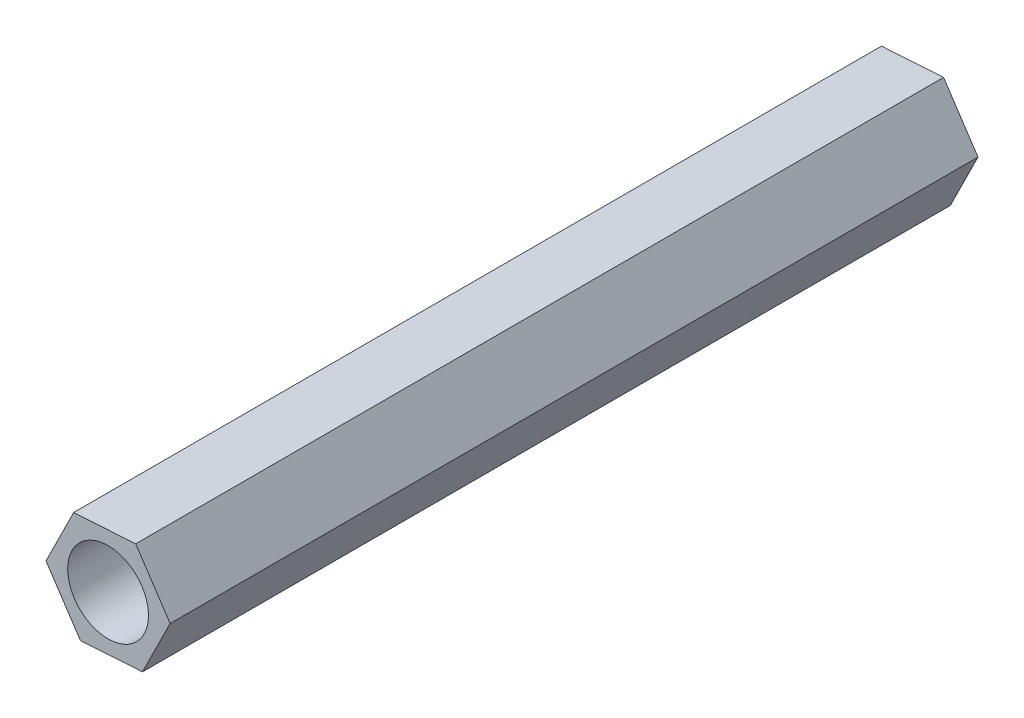
ISO-10303-21;
HEADER;
FILE_DESCRIPTION(('STEP AP214'),'2;1');
FILE_NAME('part.step','',(''),(''),'','','');
FILE_SCHEMA(('AUTOMOTIVE_DESIGN { 1 0 10303 214 1 1 1 1 }'));
ENDSEC;
DATA;
#1=APPLICATION_CONTEXT('core data for automotive mechanical design processes');
#2=APPLICATION_PROTOCOL_DEFINITION('international standard','automotive_design',2000,#1);
#3=PRODUCT_CONTEXT('',#1,'mechanical');
#4=PRODUCT('Part','Part','',(#3));
#5=PRODUCT_RELATED_PRODUCT_CATEGORY('part','',(#4));
#6=PRODUCT_DEFINITION_FORMATION('','',#4);
#7=PRODUCT_DEFINITION_CONTEXT('part definition',#1,'design');
#8=PRODUCT_DEFINITION('design','',#6,#7);
#9=PRODUCT_DEFINITION_SHAPE('','',#8);
#10=(LENGTH_UNIT() NAMED_UNIT(*) SI_UNIT(.MILLI.,.METRE.));
#11=(NAMED_UNIT(*) PLANE_ANGLE_UNIT() SI_UNIT($,.RADIAN.));
#12=(NAMED_UNIT(*) SI_UNIT($,.STERADIAN.) SOLID_ANGLE_UNIT());
#13=UNCERTAINTY_MEASURE_WITH_UNIT(LENGTH_MEASURE(1.E-05),#10,'distance_accuracy_value','');
#14=(GEOMETRIC_REPRESENTATION_CONTEXT(3) GLOBAL_UNCERTAINTY_ASSIGNED_CONTEXT((#13)) GLOBAL_UNIT_ASSIGNED_CONTEXT((#10,
#11,#12)) REPRESENTATION_CONTEXT('',''));
#15=CARTESIAN_POINT('',(0.,0.,0.));
#16=DIRECTION('',(0.,0.,1.));
#17=DIRECTION('',(1.,0.,0.));
#18=AXIS2_PLACEMENT_3D('',#15,#16,#17);
#19=CARTESIAN_POINT('',(2.30480420030551,0.145639732172981,30.));
#20=DIRECTION('',(-0.832769648149025,-0.55361964661828,0.));
#21=DIRECTION('',(0.55361964661828,-0.832769648149025,0.));
#22=AXIS2_PLACEMENT_3D('',#19,#20,#21);
#23=PLANE('',#22);
#24=DIRECTION('',(-0.55361964661828,0.832769648149025,0.));
#25=VECTOR('',#24,1.);
#26=CARTESIAN_POINT('',(2.30480420030551,0.145639732172981,0.));
#27=LINE('',#26,#25);
#28=CARTESIAN_POINT('',(2.30480420030551,0.145639732172981,0.));
#29=VERTEX_POINT('',#28);
#30=CARTESIAN_POINT('',(1.02627439229059,2.06883885430014,0.));
#31=VERTEX_POINT('',#30);
#32=EDGE_CURVE('E128',#29,#31,#27,.T.);
#33=ORIENTED_EDGE('',*,*,#32,.T.);
#34=DIRECTION('',(0.,0.,-1.));
#35=VECTOR('',#34,1.);
#36=CARTESIAN_POINT('',(1.02627439229059,2.06883885430014,30.));
#37=LINE('',#36,#35);
#38=CARTESIAN_POINT('',(1.02627439229059,2.06883885430014,30.));
#39=VERTEX_POINT('',#38);
#40=EDGE_CURVE('E11',#39,#31,#37,.T.);
#41=ORIENTED_EDGE('',*,*,#40,.F.);
#42=DIRECTION('',(-0.55361964661828,0.832769648149025,0.));
#43=VECTOR('',#42,1.);
#44=CARTESIAN_POINT('',(2.30480420030551,0.145639732172981,30.));
#45=LINE('',#44,#43);
#46=CARTESIAN_POINT('',(2.30480420030551,0.145639732172981,30.));
#47=VERTEX_POINT('',#46);
#48=EDGE_CURVE('E145',#47,#39,#45,.T.);
#49=ORIENTED_EDGE('',*,*,#48,.F.);
#50=DIRECTION('',(0.,0.,-1.));
#51=VECTOR('',#50,1.);
#52=CARTESIAN_POINT('',(2.30480420030551,0.145639732172981,30.));
#53=LINE('',#52,#51);
#54=EDGE_CURVE('E124',#47,#29,#53,.T.);
#55=ORIENTED_EDGE('',*,*,#54,.T.);
#56=EDGE_LOOP('',(#33,#41,#49,#55));
#57=FACE_BOUND('',#56,.T.);
#58=ADVANCED_FACE('F39',(#57),#23,.F.);
#59=CARTESIAN_POINT('',(1.02627439229059,2.06883885430014,30.));
#60=DIRECTION('',(0.0630638539310811,-0.998009494106824,0.));
#61=DIRECTION('',(0.998009494106824,0.0630638539310811,0.));
#62=AXIS2_PLACEMENT_3D('',#59,#60,#61);
#63=PLANE('',#62);
#64=DIRECTION('',(-0.998009494106824,-0.0630638539310811,0.));
#65=VECTOR('',#64,1.);
#66=CARTESIAN_POINT('',(1.02627439229059,2.06883885430014,0.));
#67=LINE('',#66,#65);
#68=CARTESIAN_POINT('',(-1.27852980801492,1.92319912212716,0.));
#69=VERTEX_POINT('',#68);
#70=EDGE_CURVE('E132',#31,#69,#67,.T.);
#71=ORIENTED_EDGE('',*,*,#70,.T.);
#72=DIRECTION('',(0.,0.,-1.));
#73=VECTOR('',#72,1.);
#74=CARTESIAN_POINT('',(-1.27852980801492,1.92319912212716,30.));
#75=LINE('',#74,#73);
#76=CARTESIAN_POINT('',(-1.27852980801492,1.92319912212716,30.));
#77=VERTEX_POINT('',#76);
#78=EDGE_CURVE('E48',#77,#69,#75,.T.);
#79=ORIENTED_EDGE('',*,*,#78,.F.);
#80=DIRECTION('',(-0.998009494106824,-0.0630638539310811,0.));
#81=VECTOR('',#80,1.);
#82=CARTESIAN_POINT('',(1.02627439229059,2.06883885430014,30.));
#83=LINE('',#82,#81);
#84=EDGE_CURVE('E93',#39,#77,#83,.T.);
#85=ORIENTED_EDGE('',*,*,#84,.F.);
#86=ORIENTED_EDGE('',*,*,#40,.T.);
#87=EDGE_LOOP('',(#71,#79,#85,#86));
#88=FACE_BOUND('',#87,.T.);
#89=ADVANCED_FACE('F174',(#88),#63,.F.);
#90=CARTESIAN_POINT('',(-1.27852980801492,1.92319912212716,30.));
#91=DIRECTION('',(0.895833502080107,-0.444389847488544,0.));
#92=DIRECTION('',(0.444389847488544,0.895833502080107,0.));
#93=AXIS2_PLACEMENT_3D('',#90,#91,#92);
#94=PLANE('',#93);
#95=DIRECTION('',(-0.444389847488544,-0.895833502080107,0.));
#96=VECTOR('',#95,1.);
#97=CARTESIAN_POINT('',(-1.27852980801492,1.92319912212716,0.));
#98=LINE('',#97,#96);
#99=CARTESIAN_POINT('',(-2.30480420030551,-0.145639732172981,0.));
#100=VERTEX_POINT('',#99);
#101=EDGE_CURVE('E136',#69,#100,#98,.T.);
#102=ORIENTED_EDGE('',*,*,#101,.T.);
#103=DIRECTION('',(0.,0.,-1.));
#104=VECTOR('',#103,1.);
#105=CARTESIAN_POINT('',(-2.30480420030551,-0.145639732172981,30.));
#106=LINE('',#105,#104);
#107=CARTESIAN_POINT('',(-2.30480420030551,-0.145639732172981,30.));
#108=VERTEX_POINT('',#107);
#109=EDGE_CURVE('E117',#108,#100,#106,.T.);
#110=ORIENTED_EDGE('',*,*,#109,.F.);
#111=DIRECTION('',(-0.444389847488544,-0.895833502080107,0.));
#112=VECTOR('',#111,1.);
#113=CARTESIAN_POINT('',(-1.27852980801492,1.92319912212716,30.));
#114=LINE('',#113,#112);
#115=EDGE_CURVE('E106',#77,#108,#114,.T.);
#116=ORIENTED_EDGE('',*,*,#115,.F.);
#117=ORIENTED_EDGE('',*,*,#78,.T.);
#118=EDGE_LOOP('',(#102,#110,#116,#117));
#119=FACE_BOUND('',#118,.T.);
#120=ADVANCED_FACE('F155',(#119),#94,.F.);
#121=CARTESIAN_POINT('',(-2.30480420030551,-0.145639732172981,30.));
#122=DIRECTION('',(0.832769648149025,0.55361964661828,0.));
#123=DIRECTION('',(-0.55361964661828,0.832769648149025,0.));
#124=AXIS2_PLACEMENT_3D('',#121,#122,#123);
#125=PLANE('',#124);
#126=DIRECTION('',(0.55361964661828,-0.832769648149025,0.));
#127=VECTOR('',#126,1.);
#128=CARTESIAN_POINT('',(-2.30480420030551,-0.145639732172981,0.));
#129=LINE('',#128,#127);
#130=CARTESIAN_POINT('',(-1.02627439229059,-2.06883885430014,0.));
#131=VERTEX_POINT('',#130);
#132=EDGE_CURVE('E115',#100,#131,#129,.T.);
#133=ORIENTED_EDGE('',*,*,#132,.T.);
#134=DIRECTION('',(0.,0.,-1.));
#135=VECTOR('',#134,1.);
#136=CARTESIAN_POINT('',(-1.02627439229059,-2.06883885430014,30.));
#137=LINE('',#136,#135);
#138=CARTESIAN_POINT('',(-1.02627439229059,-2.06883885430014,30.));
#139=VERTEX_POINT('',#138);
#140=EDGE_CURVE('E112',#139,#131,#137,.T.);
#141=ORIENTED_EDGE('',*,*,#140,.F.);
#142=DIRECTION('',(0.55361964661828,-0.832769648149025,0.));
#143=VECTOR('',#142,1.);
#144=CARTESIAN_POINT('',(-2.30480420030551,-0.145639732172981,30.));
#145=LINE('',#144,#143);
#146=EDGE_CURVE('E100',#108,#139,#145,.T.);
#147=ORIENTED_EDGE('',*,*,#146,.F.);
#148=ORIENTED_EDGE('',*,*,#109,.T.);
#149=EDGE_LOOP('',(#133,#141,#147,#148));
#150=FACE_BOUND('',#149,.T.);
#151=ADVANCED_FACE('F113',(#150),#125,.F.);
#152=CARTESIAN_POINT('',(-1.02627439229059,-2.06883885430014,30.));
#153=DIRECTION('',(-0.0630638539310813,0.998009494106824,0.));
#154=DIRECTION('',(-0.998009494106824,-0.0630638539310813,0.));
#155=AXIS2_PLACEMENT_3D('',#152,#153,#154);
#156=PLANE('',#155);
#157=DIRECTION('',(0.998009494106824,0.0630638539310813,0.));
#158=VECTOR('',#157,1.);
#159=CARTESIAN_POINT('',(-1.02627439229059,-2.06883885430014,0.));
#160=LINE('',#159,#158);
#161=CARTESIAN_POINT('',(1.27852980801492,-1.92319912212716,0.));
#162=VERTEX_POINT('',#161);
#163=EDGE_CURVE('E79',#131,#162,#160,.T.);
#164=ORIENTED_EDGE('',*,*,#163,.T.);
#165=DIRECTION('',(0.,0.,-1.));
#166=VECTOR('',#165,1.);
#167=CARTESIAN_POINT('',(1.27852980801492,-1.92319912212716,30.));
#168=LINE('',#167,#166);
#169=CARTESIAN_POINT('',(1.27852980801492,-1.92319912212716,30.));
#170=VERTEX_POINT('',#169);
#171=EDGE_CURVE('E118',#170,#162,#168,.T.);
#172=ORIENTED_EDGE('',*,*,#171,.F.);
#173=DIRECTION('',(0.998009494106824,0.0630638539310813,0.));
#174=VECTOR('',#173,1.);
#175=CARTESIAN_POINT('',(-1.02627439229059,-2.06883885430014,30.));
#176=LINE('',#175,#174);
#177=EDGE_CURVE('E104',#139,#170,#176,.T.);
#178=ORIENTED_EDGE('',*,*,#177,.F.);
#179=ORIENTED_EDGE('',*,*,#140,.T.);
#180=EDGE_LOOP('',(#164,#172,#178,#179));
#181=FACE_BOUND('',#180,.T.);
#182=ADVANCED_FACE('F120',(#181),#156,.F.);
#183=CARTESIAN_POINT('',(1.27852980801492,-1.92319912212716,30.));
#184=DIRECTION('',(-0.895833502080106,0.444389847488544,0.));
#185=DIRECTION('',(-0.444389847488545,-0.895833502080107,0.));
#186=AXIS2_PLACEMENT_3D('',#183,#184,#185);
#187=PLANE('',#186);
#188=DIRECTION('',(0.444389847488544,0.895833502080106,0.));
#189=VECTOR('',#188,1.);
#190=CARTESIAN_POINT('',(1.27852980801492,-1.92319912212716,0.));
#191=LINE('',#190,#189);
#192=EDGE_CURVE('E85',#162,#29,#191,.T.);
#193=ORIENTED_EDGE('',*,*,#192,.T.);
#194=ORIENTED_EDGE('',*,*,#54,.F.);
#195=DIRECTION('',(0.444389847488544,0.895833502080106,0.));
#196=VECTOR('',#195,1.);
#197=CARTESIAN_POINT('',(1.27852980801492,-1.92319912212716,30.));
#198=LINE('',#197,#196);
#199=EDGE_CURVE('E56',#170,#47,#198,.T.);
#200=ORIENTED_EDGE('',*,*,#199,.F.);
#201=ORIENTED_EDGE('',*,*,#171,.T.);
#202=EDGE_LOOP('',(#193,#194,#200,#201));
#203=FACE_BOUND('',#202,.T.);
#204=ADVANCED_FACE('F162',(#203),#187,.F.);
#205=CARTESIAN_POINT('',(0.,0.,30.));
#206=DIRECTION('',(0.,0.,1.));
#207=DIRECTION('',(1.,0.,0.));
#208=AXIS2_PLACEMENT_3D('',#205,#206,#207);
#209=PLANE('',#208);
#210=CARTESIAN_POINT('',(0.,0.,30.));
#211=DIRECTION('',(0.,0.,-1.));
#212=DIRECTION('',(-1.,0.,0.));
#213=AXIS2_PLACEMENT_3D('',#210,#211,#212);
#214=CIRCLE('',#213,1.5);
#215=CARTESIAN_POINT('',(-1.5,0.,30.));
#216=VERTEX_POINT('',#215);
#217=EDGE_CURVE('E133',#216,#216,#214,.T.);
#218=ORIENTED_EDGE('',*,*,#217,.T.);
#219=EDGE_LOOP('',(#218));
#220=FACE_BOUND('',#219,.T.);
#221=ORIENTED_EDGE('',*,*,#48,.T.);
#222=ORIENTED_EDGE('',*,*,#84,.T.);
#223=ORIENTED_EDGE('',*,*,#115,.T.);
#224=ORIENTED_EDGE('',*,*,#146,.T.);
#225=ORIENTED_EDGE('',*,*,#177,.T.);
#226=ORIENTED_EDGE('',*,*,#199,.T.);
#227=EDGE_LOOP('',(#221,#222,#223,#224,#225,#226));
#228=FACE_BOUND('',#227,.T.);
#229=ADVANCED_FACE('F102',(#220,#228),#209,.T.);
#230=CARTESIAN_POINT('',(0.,0.,0.));
#231=DIRECTION('',(0.,0.,1.));
#232=DIRECTION('',(1.,0.,0.));
#233=AXIS2_PLACEMENT_3D('',#230,#231,#232);
#234=PLANE('',#233);
#235=CARTESIAN_POINT('',(0.,0.,0.));
#236=DIRECTION('',(0.,0.,-1.));
#237=DIRECTION('',(-1.,0.,0.));
#238=AXIS2_PLACEMENT_3D('',#235,#236,#237);
#239=CIRCLE('',#238,1.5);
#240=CARTESIAN_POINT('',(-1.5,0.,0.));
#241=VERTEX_POINT('',#240);
#242=EDGE_CURVE('E229',#241,#241,#239,.T.);
#243=ORIENTED_EDGE('',*,*,#242,.F.);
#244=EDGE_LOOP('',(#243));
#245=FACE_BOUND('',#244,.T.);
#246=ORIENTED_EDGE('',*,*,#32,.F.);
#247=ORIENTED_EDGE('',*,*,#192,.F.);
#248=ORIENTED_EDGE('',*,*,#163,.F.);
#249=ORIENTED_EDGE('',*,*,#132,.F.);
#250=ORIENTED_EDGE('',*,*,#101,.F.);
#251=ORIENTED_EDGE('',*,*,#70,.F.);
#252=EDGE_LOOP('',(#246,#247,#248,#249,#250,#251));
#253=FACE_BOUND('',#252,.T.);
#254=ADVANCED_FACE('F158',(#245,#253),#234,.F.);
#255=CARTESIAN_POINT('',(0.,0.,30.));
#256=DIRECTION('',(0.,0.,-1.));
#257=DIRECTION('',(-1.,0.,0.));
#258=AXIS2_PLACEMENT_3D('',#255,#256,#257);
#259=CYLINDRICAL_SURFACE('',#258,1.5);
#260=ORIENTED_EDGE('',*,*,#217,.F.);
#261=EDGE_LOOP('',(#260));
#262=FACE_BOUND('',#261,.T.);
#263=ORIENTED_EDGE('',*,*,#242,.T.);
#264=EDGE_LOOP('',(#263));
#265=FACE_BOUND('',#264,.T.);
#266=ADVANCED_FACE('F211',(#262,#265),#259,.F.);
#267=CLOSED_SHELL('',(#58,#89,#120,#151,#182,#204,#229,#254,#266));
#268=MANIFOLD_SOLID_BREP('B2',#267);
#269=ADVANCED_BREP_SHAPE_REPRESENTATION('',(#18,#268),#14);
#270=SHAPE_DEFINITION_REPRESENTATION(#9,#269);
ENDSEC;
END-ISO-10303-21;
